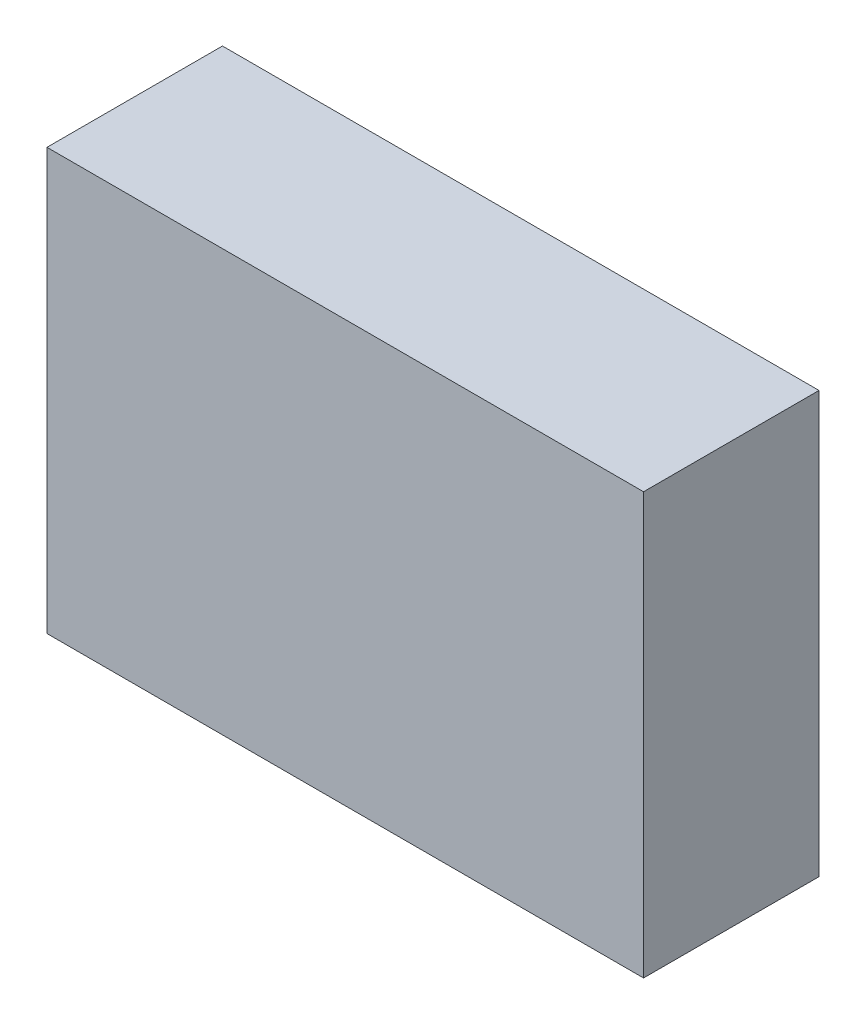
ISO-10303-21;
HEADER;
FILE_DESCRIPTION(('STEP AP214'),'2;1');
FILE_NAME('part.step','',(''),(''),'','','');
FILE_SCHEMA(('AUTOMOTIVE_DESIGN { 1 0 10303 214 1 1 1 1 }'));
ENDSEC;
DATA;
#1=APPLICATION_CONTEXT('core data for automotive mechanical design processes');
#2=APPLICATION_PROTOCOL_DEFINITION('international standard','automotive_design',2000,#1);
#3=PRODUCT_CONTEXT('',#1,'mechanical');
#4=PRODUCT('Part','Part','',(#3));
#5=PRODUCT_RELATED_PRODUCT_CATEGORY('part','',(#4));
#6=PRODUCT_DEFINITION_FORMATION('','',#4);
#7=PRODUCT_DEFINITION_CONTEXT('part definition',#1,'design');
#8=PRODUCT_DEFINITION('design','',#6,#7);
#9=PRODUCT_DEFINITION_SHAPE('','',#8);
#10=(LENGTH_UNIT() NAMED_UNIT(*) SI_UNIT(.MILLI.,.METRE.));
#11=(NAMED_UNIT(*) PLANE_ANGLE_UNIT() SI_UNIT($,.RADIAN.));
#12=(NAMED_UNIT(*) SI_UNIT($,.STERADIAN.) SOLID_ANGLE_UNIT());
#13=UNCERTAINTY_MEASURE_WITH_UNIT(LENGTH_MEASURE(1.E-05),#10,'distance_accuracy_value','');
#14=(GEOMETRIC_REPRESENTATION_CONTEXT(3) GLOBAL_UNCERTAINTY_ASSIGNED_CONTEXT((#13)) GLOBAL_UNIT_ASSIGNED_CONTEXT((#10,
#11,#12)) REPRESENTATION_CONTEXT('',''));
#15=CARTESIAN_POINT('',(0.,0.,0.));
#16=DIRECTION('',(0.,0.,1.));
#17=DIRECTION('',(1.,0.,0.));
#18=AXIS2_PLACEMENT_3D('',#15,#16,#17);
#19=CARTESIAN_POINT('',(-2.92,-0.37,0.));
#20=DIRECTION('',(1.,0.,0.));
#21=DIRECTION('',(0.,0.,1.));
#22=AXIS2_PLACEMENT_3D('',#19,#20,#21);
#23=PLANE('',#22);
#24=DIRECTION('',(0.,1.,0.));
#25=VECTOR('',#24,1.);
#26=CARTESIAN_POINT('',(-2.92,-0.37,0.1));
#27=LINE('',#26,#25);
#28=CARTESIAN_POINT('',(-2.92,-0.37,0.1));
#29=VERTEX_POINT('',#28);
#30=CARTESIAN_POINT('',(-2.92,-0.13,0.1));
#31=VERTEX_POINT('',#30);
#32=EDGE_CURVE('E11',#29,#31,#27,.T.);
#33=ORIENTED_EDGE('',*,*,#32,.T.);
#34=DIRECTION('',(0.,0.,1.));
#35=VECTOR('',#34,1.);
#36=CARTESIAN_POINT('',(-2.92,-0.13,0.));
#37=LINE('',#36,#35);
#38=CARTESIAN_POINT('',(-2.92,-0.13,0.));
#39=VERTEX_POINT('',#38);
#40=EDGE_CURVE('E24',#39,#31,#37,.T.);
#41=ORIENTED_EDGE('',*,*,#40,.F.);
#42=DIRECTION('',(0.,1.,0.));
#43=VECTOR('',#42,1.);
#44=CARTESIAN_POINT('',(-2.92,-0.37,0.));
#45=LINE('',#44,#43);
#46=CARTESIAN_POINT('',(-2.92,-0.37,0.));
#47=VERTEX_POINT('',#46);
#48=EDGE_CURVE('E86',#47,#39,#45,.T.);
#49=ORIENTED_EDGE('',*,*,#48,.F.);
#50=DIRECTION('',(0.,0.,1.));
#51=VECTOR('',#50,1.);
#52=CARTESIAN_POINT('',(-2.92,-0.37,0.));
#53=LINE('',#52,#51);
#54=EDGE_CURVE('E36',#47,#29,#53,.T.);
#55=ORIENTED_EDGE('',*,*,#54,.T.);
#56=EDGE_LOOP('',(#33,#41,#49,#55));
#57=FACE_BOUND('',#56,.T.);
#58=ADVANCED_FACE('F17',(#57),#23,.F.);
#59=CARTESIAN_POINT('',(-2.58,-0.37,0.));
#60=DIRECTION('',(1.,0.,0.));
#61=DIRECTION('',(0.,0.,1.));
#62=AXIS2_PLACEMENT_3D('',#59,#60,#61);
#63=PLANE('',#62);
#64=DIRECTION('',(0.,0.,1.));
#65=VECTOR('',#64,1.);
#66=CARTESIAN_POINT('',(-2.58,-0.37,0.));
#67=LINE('',#66,#65);
#68=CARTESIAN_POINT('',(-2.58,-0.37,0.));
#69=VERTEX_POINT('',#68);
#70=CARTESIAN_POINT('',(-2.58,-0.37,0.1));
#71=VERTEX_POINT('',#70);
#72=EDGE_CURVE('E83',#69,#71,#67,.T.);
#73=ORIENTED_EDGE('',*,*,#72,.F.);
#74=DIRECTION('',(0.,1.,0.));
#75=VECTOR('',#74,1.);
#76=CARTESIAN_POINT('',(-2.58,-0.37,0.));
#77=LINE('',#76,#75);
#78=CARTESIAN_POINT('',(-2.58,-0.13,0.));
#79=VERTEX_POINT('',#78);
#80=EDGE_CURVE('E63',#69,#79,#77,.T.);
#81=ORIENTED_EDGE('',*,*,#80,.T.);
#82=DIRECTION('',(0.,0.,1.));
#83=VECTOR('',#82,1.);
#84=CARTESIAN_POINT('',(-2.58,-0.13,0.));
#85=LINE('',#84,#83);
#86=CARTESIAN_POINT('',(-2.58,-0.13,0.1));
#87=VERTEX_POINT('',#86);
#88=EDGE_CURVE('E57',#79,#87,#85,.T.);
#89=ORIENTED_EDGE('',*,*,#88,.T.);
#90=DIRECTION('',(0.,1.,0.));
#91=VECTOR('',#90,1.);
#92=CARTESIAN_POINT('',(-2.58,-0.37,0.1));
#93=LINE('',#92,#91);
#94=EDGE_CURVE('E60',#71,#87,#93,.T.);
#95=ORIENTED_EDGE('',*,*,#94,.F.);
#96=EDGE_LOOP('',(#73,#81,#89,#95));
#97=FACE_BOUND('',#96,.T.);
#98=ADVANCED_FACE('F59',(#97),#63,.T.);
#99=CARTESIAN_POINT('',(-2.92,-0.37,0.));
#100=DIRECTION('',(0.,1.,0.));
#101=DIRECTION('',(0.,0.,1.));
#102=AXIS2_PLACEMENT_3D('',#99,#100,#101);
#103=PLANE('',#102);
#104=ORIENTED_EDGE('',*,*,#72,.T.);
#105=DIRECTION('',(1.,0.,0.));
#106=VECTOR('',#105,1.);
#107=CARTESIAN_POINT('',(-2.92,-0.37,0.1));
#108=LINE('',#107,#106);
#109=EDGE_CURVE('E71',#29,#71,#108,.T.);
#110=ORIENTED_EDGE('',*,*,#109,.F.);
#111=ORIENTED_EDGE('',*,*,#54,.F.);
#112=DIRECTION('',(1.,0.,0.));
#113=VECTOR('',#112,1.);
#114=CARTESIAN_POINT('',(-2.92,-0.37,0.));
#115=LINE('',#114,#113);
#116=EDGE_CURVE('E76',#47,#69,#115,.T.);
#117=ORIENTED_EDGE('',*,*,#116,.T.);
#118=EDGE_LOOP('',(#104,#110,#111,#117));
#119=FACE_BOUND('',#118,.T.);
#120=ADVANCED_FACE('F91',(#119),#103,.F.);
#121=CARTESIAN_POINT('',(-2.92,-0.13,0.));
#122=DIRECTION('',(0.,1.,0.));
#123=DIRECTION('',(0.,0.,1.));
#124=AXIS2_PLACEMENT_3D('',#121,#122,#123);
#125=PLANE('',#124);
#126=DIRECTION('',(1.,0.,0.));
#127=VECTOR('',#126,1.);
#128=CARTESIAN_POINT('',(-2.92,-0.13,0.));
#129=LINE('',#128,#127);
#130=EDGE_CURVE('E74',#39,#79,#129,.T.);
#131=ORIENTED_EDGE('',*,*,#130,.F.);
#132=ORIENTED_EDGE('',*,*,#40,.T.);
#133=DIRECTION('',(1.,0.,0.));
#134=VECTOR('',#133,1.);
#135=CARTESIAN_POINT('',(-2.92,-0.13,0.1));
#136=LINE('',#135,#134);
#137=EDGE_CURVE('E69',#31,#87,#136,.T.);
#138=ORIENTED_EDGE('',*,*,#137,.T.);
#139=ORIENTED_EDGE('',*,*,#88,.F.);
#140=EDGE_LOOP('',(#131,#132,#138,#139));
#141=FACE_BOUND('',#140,.T.);
#142=ADVANCED_FACE('F73',(#141),#125,.T.);
#143=CARTESIAN_POINT('',(-2.92,-0.37,0.));
#144=DIRECTION('',(0.,0.,1.));
#145=DIRECTION('',(1.,0.,0.));
#146=AXIS2_PLACEMENT_3D('',#143,#144,#145);
#147=PLANE('',#146);
#148=ORIENTED_EDGE('',*,*,#130,.T.);
#149=ORIENTED_EDGE('',*,*,#80,.F.);
#150=ORIENTED_EDGE('',*,*,#116,.F.);
#151=ORIENTED_EDGE('',*,*,#48,.T.);
#152=EDGE_LOOP('',(#148,#149,#150,#151));
#153=FACE_BOUND('',#152,.T.);
#154=ADVANCED_FACE('F89',(#153),#147,.F.);
#155=CARTESIAN_POINT('',(-2.92,-0.37,0.1));
#156=DIRECTION('',(0.,0.,1.));
#157=DIRECTION('',(1.,0.,0.));
#158=AXIS2_PLACEMENT_3D('',#155,#156,#157);
#159=PLANE('',#158);
#160=ORIENTED_EDGE('',*,*,#32,.F.);
#161=ORIENTED_EDGE('',*,*,#109,.T.);
#162=ORIENTED_EDGE('',*,*,#94,.T.);
#163=ORIENTED_EDGE('',*,*,#137,.F.);
#164=EDGE_LOOP('',(#160,#161,#162,#163));
#165=FACE_BOUND('',#164,.T.);
#166=ADVANCED_FACE('F68',(#165),#159,.T.);
#167=CLOSED_SHELL('',(#58,#98,#120,#142,#154,#166));
#168=MANIFOLD_SOLID_BREP('B1',#167);
#169=ADVANCED_BREP_SHAPE_REPRESENTATION('',(#18,#168),#14);
#170=SHAPE_DEFINITION_REPRESENTATION(#9,#169);
ENDSEC;
END-ISO-10303-21;
